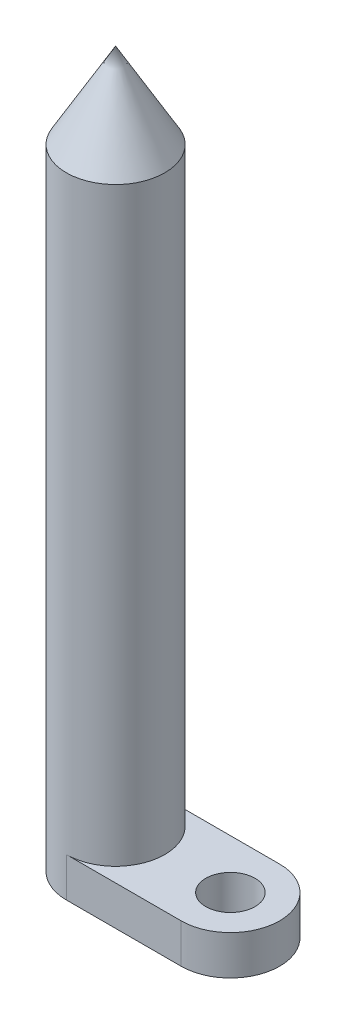
ISO-10303-21;
HEADER;
FILE_DESCRIPTION(('STEP AP214'),'2;1');
FILE_NAME('part.step','',(''),(''),'','','');
FILE_SCHEMA(('AUTOMOTIVE_DESIGN { 1 0 10303 214 1 1 1 1 }'));
ENDSEC;
DATA;
#1=APPLICATION_CONTEXT('core data for automotive mechanical design processes');
#2=APPLICATION_PROTOCOL_DEFINITION('international standard','automotive_design',2000,#1);
#3=PRODUCT_CONTEXT('',#1,'mechanical');
#4=PRODUCT('Part','Part','',(#3));
#5=PRODUCT_RELATED_PRODUCT_CATEGORY('part','',(#4));
#6=PRODUCT_DEFINITION_FORMATION('','',#4);
#7=PRODUCT_DEFINITION_CONTEXT('part definition',#1,'design');
#8=PRODUCT_DEFINITION('design','',#6,#7);
#9=PRODUCT_DEFINITION_SHAPE('','',#8);
#10=(LENGTH_UNIT() NAMED_UNIT(*) SI_UNIT(.MILLI.,.METRE.));
#11=(NAMED_UNIT(*) PLANE_ANGLE_UNIT() SI_UNIT($,.RADIAN.));
#12=(NAMED_UNIT(*) SI_UNIT($,.STERADIAN.) SOLID_ANGLE_UNIT());
#13=UNCERTAINTY_MEASURE_WITH_UNIT(LENGTH_MEASURE(1.E-05),#10,'distance_accuracy_value','');
#14=(GEOMETRIC_REPRESENTATION_CONTEXT(3) GLOBAL_UNCERTAINTY_ASSIGNED_CONTEXT((#13)) GLOBAL_UNIT_ASSIGNED_CONTEXT((#10,
#11,#12)) REPRESENTATION_CONTEXT('',''));
#15=CARTESIAN_POINT('',(0.,0.,0.));
#16=DIRECTION('',(0.,0.,1.));
#17=DIRECTION('',(1.,0.,0.));
#18=AXIS2_PLACEMENT_3D('',#15,#16,#17);
#19=CARTESIAN_POINT('',(0.,12.,0.));
#20=DIRECTION('',(0.,1.,0.));
#21=DIRECTION('',(0.,0.,1.));
#22=AXIS2_PLACEMENT_3D('',#19,#20,#21);
#23=PLANE('',#22);
#24=CARTESIAN_POINT('',(0.,12.,0.));
#25=DIRECTION('',(0.,1.,0.));
#26=DIRECTION('',(0.,0.,1.));
#27=AXIS2_PLACEMENT_3D('',#24,#25,#26);
#28=CIRCLE('',#27,15.);
#29=CARTESIAN_POINT('',(0.,12.,15.));
#30=VERTEX_POINT('',#29);
#31=CARTESIAN_POINT('',(0.,12.,-15.));
#32=VERTEX_POINT('',#31);
#33=EDGE_CURVE('E94',#30,#32,#28,.T.);
#34=ORIENTED_EDGE('',*,*,#33,.F.);
#35=DIRECTION('',(1.,0.,0.));
#36=VECTOR('',#35,1.);
#37=CARTESIAN_POINT('',(0.,12.,15.));
#38=LINE('',#37,#36);
#39=CARTESIAN_POINT('',(35.,12.,15.));
#40=VERTEX_POINT('',#39);
#41=EDGE_CURVE('E76',#30,#40,#38,.T.);
#42=ORIENTED_EDGE('',*,*,#41,.T.);
#43=CARTESIAN_POINT('',(35.,12.,0.));
#44=DIRECTION('',(0.,1.,0.));
#45=DIRECTION('',(0.,0.,1.));
#46=AXIS2_PLACEMENT_3D('',#43,#44,#45);
#47=CIRCLE('',#46,15.);
#48=CARTESIAN_POINT('',(35.,12.,-15.));
#49=VERTEX_POINT('',#48);
#50=EDGE_CURVE('E106',#40,#49,#47,.T.);
#51=ORIENTED_EDGE('',*,*,#50,.T.);
#52=DIRECTION('',(-1.,0.,0.));
#53=VECTOR('',#52,1.);
#54=CARTESIAN_POINT('',(0.,12.,-15.));
#55=LINE('',#54,#53);
#56=EDGE_CURVE('E49',#49,#32,#55,.T.);
#57=ORIENTED_EDGE('',*,*,#56,.T.);
#58=EDGE_LOOP('',(#34,#42,#51,#57));
#59=FACE_BOUND('',#58,.T.);
#60=CARTESIAN_POINT('',(35.,12.,0.));
#61=DIRECTION('',(0.,1.,0.));
#62=DIRECTION('',(0.,0.,1.));
#63=AXIS2_PLACEMENT_3D('',#60,#61,#62);
#64=CIRCLE('',#63,7.5);
#65=CARTESIAN_POINT('',(35.,12.,7.5));
#66=VERTEX_POINT('',#65);
#67=EDGE_CURVE('E97',#66,#66,#64,.T.);
#68=ORIENTED_EDGE('',*,*,#67,.F.);
#69=EDGE_LOOP('',(#68));
#70=FACE_BOUND('',#69,.T.);
#71=ADVANCED_FACE('F32',(#59,#70),#23,.T.);
#72=CARTESIAN_POINT('',(0.,0.,0.));
#73=DIRECTION('',(0.,1.,0.));
#74=DIRECTION('',(0.,0.,1.));
#75=AXIS2_PLACEMENT_3D('',#72,#73,#74);
#76=PLANE('',#75);
#77=CARTESIAN_POINT('',(0.,0.,0.));
#78=DIRECTION('',(0.,1.,0.));
#79=DIRECTION('',(0.,0.,1.));
#80=AXIS2_PLACEMENT_3D('',#77,#78,#79);
#81=CIRCLE('',#80,15.);
#82=CARTESIAN_POINT('',(0.,0.,-15.));
#83=VERTEX_POINT('',#82);
#84=CARTESIAN_POINT('',(0.,0.,15.));
#85=VERTEX_POINT('',#84);
#86=EDGE_CURVE('E103',#83,#85,#81,.T.);
#87=ORIENTED_EDGE('',*,*,#86,.F.);
#88=DIRECTION('',(-1.,0.,0.));
#89=VECTOR('',#88,1.);
#90=CARTESIAN_POINT('',(0.,0.,-15.));
#91=LINE('',#90,#89);
#92=CARTESIAN_POINT('',(35.,0.,-15.));
#93=VERTEX_POINT('',#92);
#94=EDGE_CURVE('E72',#93,#83,#91,.T.);
#95=ORIENTED_EDGE('',*,*,#94,.F.);
#96=CARTESIAN_POINT('',(35.,0.,0.));
#97=DIRECTION('',(0.,1.,0.));
#98=DIRECTION('',(0.,0.,1.));
#99=AXIS2_PLACEMENT_3D('',#96,#97,#98);
#100=CIRCLE('',#99,15.);
#101=CARTESIAN_POINT('',(35.,0.,15.));
#102=VERTEX_POINT('',#101);
#103=EDGE_CURVE('E67',#102,#93,#100,.T.);
#104=ORIENTED_EDGE('',*,*,#103,.F.);
#105=DIRECTION('',(1.,0.,0.));
#106=VECTOR('',#105,1.);
#107=CARTESIAN_POINT('',(0.,0.,15.));
#108=LINE('',#107,#106);
#109=EDGE_CURVE('E112',#85,#102,#108,.T.);
#110=ORIENTED_EDGE('',*,*,#109,.F.);
#111=EDGE_LOOP('',(#87,#95,#104,#110));
#112=FACE_BOUND('',#111,.T.);
#113=CARTESIAN_POINT('',(35.,0.,0.));
#114=DIRECTION('',(0.,1.,0.));
#115=DIRECTION('',(0.,0.,1.));
#116=AXIS2_PLACEMENT_3D('',#113,#114,#115);
#117=CIRCLE('',#116,7.5);
#118=CARTESIAN_POINT('',(35.,0.,7.5));
#119=VERTEX_POINT('',#118);
#120=EDGE_CURVE('E93',#119,#119,#117,.T.);
#121=ORIENTED_EDGE('',*,*,#120,.T.);
#122=EDGE_LOOP('',(#121));
#123=FACE_BOUND('',#122,.T.);
#124=ADVANCED_FACE('F123',(#112,#123),#76,.F.);
#125=CARTESIAN_POINT('',(0.,12.,0.));
#126=DIRECTION('',(0.,-1.,0.));
#127=DIRECTION('',(0.,0.,-1.));
#128=AXIS2_PLACEMENT_3D('',#125,#126,#127);
#129=CYLINDRICAL_SURFACE('',#128,15.);
#130=ORIENTED_EDGE('',*,*,#86,.T.);
#131=DIRECTION('',(0.,-1.,0.));
#132=VECTOR('',#131,1.);
#133=CARTESIAN_POINT('',(0.,12.,15.));
#134=LINE('',#133,#132);
#135=EDGE_CURVE('E11',#30,#85,#134,.T.);
#136=ORIENTED_EDGE('',*,*,#135,.F.);
#137=ORIENTED_EDGE('',*,*,#33,.T.);
#138=DIRECTION('',(0.,-1.,0.));
#139=VECTOR('',#138,1.);
#140=CARTESIAN_POINT('',(0.,12.,-15.));
#141=LINE('',#140,#139);
#142=EDGE_CURVE('E109',#32,#83,#141,.T.);
#143=ORIENTED_EDGE('',*,*,#142,.T.);
#144=EDGE_LOOP('',(#130,#136,#137,#143));
#145=FACE_BOUND('',#144,.T.);
#146=CARTESIAN_POINT('',(0.,192.,0.));
#147=DIRECTION('',(0.,1.,0.));
#148=DIRECTION('',(0.,0.,1.));
#149=AXIS2_PLACEMENT_3D('',#146,#147,#148);
#150=CIRCLE('',#149,15.);
#151=CARTESIAN_POINT('',(0.,192.,15.));
#152=VERTEX_POINT('',#151);
#153=EDGE_CURVE('E91',#152,#152,#150,.T.);
#154=ORIENTED_EDGE('',*,*,#153,.F.);
#155=EDGE_LOOP('',(#154));
#156=FACE_BOUND('',#155,.T.);
#157=ADVANCED_FACE('F34',(#145,#156),#129,.T.);
#158=CARTESIAN_POINT('',(0.,12.,15.));
#159=DIRECTION('',(0.,0.,-1.));
#160=DIRECTION('',(-1.,0.,0.));
#161=AXIS2_PLACEMENT_3D('',#158,#159,#160);
#162=PLANE('',#161);
#163=ORIENTED_EDGE('',*,*,#109,.T.);
#164=DIRECTION('',(0.,-1.,0.));
#165=VECTOR('',#164,1.);
#166=CARTESIAN_POINT('',(35.,12.,15.));
#167=LINE('',#166,#165);
#168=EDGE_CURVE('E41',#40,#102,#167,.T.);
#169=ORIENTED_EDGE('',*,*,#168,.F.);
#170=ORIENTED_EDGE('',*,*,#41,.F.);
#171=ORIENTED_EDGE('',*,*,#135,.T.);
#172=EDGE_LOOP('',(#163,#169,#170,#171));
#173=FACE_BOUND('',#172,.T.);
#174=ADVANCED_FACE('F135',(#173),#162,.F.);
#175=CARTESIAN_POINT('',(35.,12.,0.));
#176=DIRECTION('',(0.,-1.,0.));
#177=DIRECTION('',(0.,0.,-1.));
#178=AXIS2_PLACEMENT_3D('',#175,#176,#177);
#179=CYLINDRICAL_SURFACE('',#178,15.);
#180=ORIENTED_EDGE('',*,*,#103,.T.);
#181=DIRECTION('',(0.,-1.,0.));
#182=VECTOR('',#181,1.);
#183=CARTESIAN_POINT('',(35.,12.,-15.));
#184=LINE('',#183,#182);
#185=EDGE_CURVE('E117',#49,#93,#184,.T.);
#186=ORIENTED_EDGE('',*,*,#185,.F.);
#187=ORIENTED_EDGE('',*,*,#50,.F.);
#188=ORIENTED_EDGE('',*,*,#168,.T.);
#189=EDGE_LOOP('',(#180,#186,#187,#188));
#190=FACE_BOUND('',#189,.T.);
#191=ADVANCED_FACE('F119',(#190),#179,.T.);
#192=CARTESIAN_POINT('',(0.,12.,-15.));
#193=DIRECTION('',(0.,0.,1.));
#194=DIRECTION('',(1.,0.,0.));
#195=AXIS2_PLACEMENT_3D('',#192,#193,#194);
#196=PLANE('',#195);
#197=ORIENTED_EDGE('',*,*,#94,.T.);
#198=ORIENTED_EDGE('',*,*,#142,.F.);
#199=ORIENTED_EDGE('',*,*,#56,.F.);
#200=ORIENTED_EDGE('',*,*,#185,.T.);
#201=EDGE_LOOP('',(#197,#198,#199,#200));
#202=FACE_BOUND('',#201,.T.);
#203=ADVANCED_FACE('F126',(#202),#196,.F.);
#204=CARTESIAN_POINT('',(35.,12.,0.));
#205=DIRECTION('',(0.,-1.,0.));
#206=DIRECTION('',(0.,0.,-1.));
#207=AXIS2_PLACEMENT_3D('',#204,#205,#206);
#208=CYLINDRICAL_SURFACE('',#207,7.5);
#209=ORIENTED_EDGE('',*,*,#67,.T.);
#210=EDGE_LOOP('',(#209));
#211=FACE_BOUND('',#210,.T.);
#212=ORIENTED_EDGE('',*,*,#120,.F.);
#213=EDGE_LOOP('',(#212));
#214=FACE_BOUND('',#213,.T.);
#215=ADVANCED_FACE('F87',(#211,#214),#208,.F.);
#216=CARTESIAN_POINT('',(0.,192.,0.));
#217=DIRECTION('',(0.,-1.,0.));
#218=DIRECTION('',(0.,0.,-1.));
#219=AXIS2_PLACEMENT_3D('',#216,#217,#218);
#220=CONICAL_SURFACE('',#219,15.,0.523598775598293);
#221=CARTESIAN_POINT('',(0.,217.980762113534,0.));
#222=VERTEX_POINT('',#221);
#223=VERTEX_LOOP('',#222);
#224=FACE_BOUND('',#223,.T.);
#225=ORIENTED_EDGE('',*,*,#153,.T.);
#226=EDGE_LOOP('',(#225));
#227=FACE_BOUND('',#226,.T.);
#228=ADVANCED_FACE('F84',(#224,#227),#220,.T.);
#229=CLOSED_SHELL('',(#71,#124,#157,#174,#191,#203,#215,#228));
#230=MANIFOLD_SOLID_BREP('B2',#229);
#231=ADVANCED_BREP_SHAPE_REPRESENTATION('',(#18,#230),#14);
#232=SHAPE_DEFINITION_REPRESENTATION(#9,#231);
ENDSEC;
END-ISO-10303-21;
